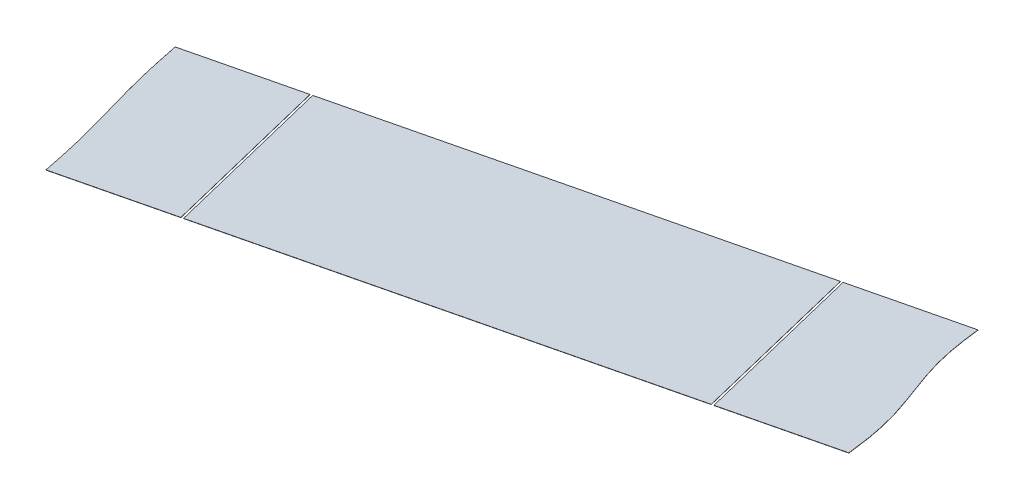
ISO-10303-21;
HEADER;
FILE_DESCRIPTION(('STEP AP214'),'2;1');
FILE_NAME('part.step','',(''),(''),'','','');
FILE_SCHEMA(('AUTOMOTIVE_DESIGN { 1 0 10303 214 1 1 1 1 }'));
ENDSEC;
DATA;
#1=APPLICATION_CONTEXT('core data for automotive mechanical design processes');
#2=APPLICATION_PROTOCOL_DEFINITION('international standard','automotive_design',2000,#1);
#3=PRODUCT_CONTEXT('',#1,'mechanical');
#4=PRODUCT('Part','Part','',(#3));
#5=PRODUCT_RELATED_PRODUCT_CATEGORY('part','',(#4));
#6=PRODUCT_DEFINITION_FORMATION('','',#4);
#7=PRODUCT_DEFINITION_CONTEXT('part definition',#1,'design');
#8=PRODUCT_DEFINITION('design','',#6,#7);
#9=PRODUCT_DEFINITION_SHAPE('','',#8);
#10=(LENGTH_UNIT() NAMED_UNIT(*) SI_UNIT(.MILLI.,.METRE.));
#11=(NAMED_UNIT(*) PLANE_ANGLE_UNIT() SI_UNIT($,.RADIAN.));
#12=(NAMED_UNIT(*) SI_UNIT($,.STERADIAN.) SOLID_ANGLE_UNIT());
#13=UNCERTAINTY_MEASURE_WITH_UNIT(LENGTH_MEASURE(1.E-05),#10,'distance_accuracy_value','');
#14=(GEOMETRIC_REPRESENTATION_CONTEXT(3) GLOBAL_UNCERTAINTY_ASSIGNED_CONTEXT((#13)) GLOBAL_UNIT_ASSIGNED_CONTEXT((#10,
#11,#12)) REPRESENTATION_CONTEXT('',''));
#15=CARTESIAN_POINT('',(0.,0.,0.));
#16=DIRECTION('',(0.,0.,1.));
#17=DIRECTION('',(1.,0.,0.));
#18=AXIS2_PLACEMENT_3D('',#15,#16,#17);
#19=CARTESIAN_POINT('',(2395.27818483003,381.38489247794,252.447974601586));
#20=DIRECTION('',(0.235073047336167,-0.00396825396826431,0.971969606199974));
#21=DIRECTION('',(0.971977259112275,0.,-0.235074898210314));
#22=AXIS2_PLACEMENT_3D('',#19,#20,#21);
#23=PLANE('',#22);
#24=DIRECTION('',(0.000932836897662165,0.999992126449225,0.00385705261553395));
#25=VECTOR('',#24,1.);
#26=CARTESIAN_POINT('',(2345.08494572677,371.384971213448,264.546496375752));
#27=LINE('',#26,#25);
#28=CARTESIAN_POINT('',(2345.09418081205,381.284893265295,264.584681196645));
#29=VERTEX_POINT('',#28);
#30=CARTESIAN_POINT('',(2345.09427409574,381.38489247794,264.585066901907));
#31=VERTEX_POINT('',#30);
#32=EDGE_CURVE('E119',#29,#31,#27,.T.);
#33=ORIENTED_EDGE('',*,*,#32,.T.);
#34=DIRECTION('',(-0.971977259112275,0.,0.235074898210314));
#35=VECTOR('',#34,1.);
#36=CARTESIAN_POINT('',(2395.27818483003,381.38489247794,252.447974601586));
#37=LINE('',#36,#35);
#38=CARTESIAN_POINT('',(2152.64277679151,381.38489247794,311.129896747549));
#39=VERTEX_POINT('',#38);
#40=EDGE_CURVE('E55',#31,#39,#37,.T.);
#41=ORIENTED_EDGE('',*,*,#40,.T.);
#42=DIRECTION('',(0.000932836897662165,0.999992126449225,0.00385705261553395));
#43=VECTOR('',#42,1.);
#44=CARTESIAN_POINT('',(2152.63344842254,371.384971213448,311.091326221394));
#45=LINE('',#44,#43);
#46=CARTESIAN_POINT('',(2152.64268350782,381.284893265295,311.129511042288));
#47=VERTEX_POINT('',#46);
#48=EDGE_CURVE('E114',#47,#39,#45,.T.);
#49=ORIENTED_EDGE('',*,*,#48,.F.);
#50=DIRECTION('',(-0.971977259112275,0.,0.235074898210314));
#51=VECTOR('',#50,1.);
#52=CARTESIAN_POINT('',(2395.27809154634,381.284893265295,252.447588896325));
#53=LINE('',#52,#51);
#54=EDGE_CURVE('E84',#29,#47,#53,.T.);
#55=ORIENTED_EDGE('',*,*,#54,.F.);
#56=EDGE_LOOP('',(#33,#41,#49,#55));
#57=FACE_BOUND('',#56,.T.);
#58=ADVANCED_FACE('F52',(#57),#23,.T.);
#59=CARTESIAN_POINT('',(2376.60605366932,381.699900005905,175.293985663563));
#60=DIRECTION('',(0.235073047336167,-0.00396825396826431,0.971969606199973));
#61=DIRECTION('',(0.971977259112275,0.,-0.235074898210314));
#62=AXIS2_PLACEMENT_3D('',#59,#60,#61);
#63=PLANE('',#62);
#64=DIRECTION('',(-0.971977259112275,0.,0.235074898210314));
#65=VECTOR('',#64,1.);
#66=CARTESIAN_POINT('',(2376.60605366932,381.699900005905,175.293985663563));
#67=LINE('',#66,#65);
#68=CARTESIAN_POINT('',(2326.4337296536,381.699900005905,187.428275689794));
#69=VERTEX_POINT('',#68);
#70=CARTESIAN_POINT('',(2133.98223234937,381.699900005905,233.973105535437));
#71=VERTEX_POINT('',#70);
#72=EDGE_CURVE('E111',#69,#71,#67,.T.);
#73=ORIENTED_EDGE('',*,*,#72,.F.);
#74=DIRECTION('',(0.000932836897662165,0.999992126449225,0.00385705261553395));
#75=VECTOR('',#74,1.);
#76=CARTESIAN_POINT('',(2326.42440128462,371.699978741413,187.389705163639));
#77=LINE('',#76,#75);
#78=CARTESIAN_POINT('',(2326.43363636991,381.59990079326,187.427889984532));
#79=VERTEX_POINT('',#78);
#80=EDGE_CURVE('E61',#79,#69,#77,.T.);
#81=ORIENTED_EDGE('',*,*,#80,.F.);
#82=DIRECTION('',(-0.971977259112275,0.,0.235074898210314));
#83=VECTOR('',#82,1.);
#84=CARTESIAN_POINT('',(2376.60596038563,381.59990079326,175.293599958301));
#85=LINE('',#84,#83);
#86=CARTESIAN_POINT('',(2133.98213906568,381.59990079326,233.972719830176));
#87=VERTEX_POINT('',#86);
#88=EDGE_CURVE('E100',#79,#87,#85,.T.);
#89=ORIENTED_EDGE('',*,*,#88,.T.);
#90=DIRECTION('',(0.000932836897662165,0.999992126449225,0.00385705261553395));
#91=VECTOR('',#90,1.);
#92=CARTESIAN_POINT('',(2133.97290398039,371.699978741413,233.934535009282));
#93=LINE('',#92,#91);
#94=EDGE_CURVE('E104',#87,#71,#93,.T.);
#95=ORIENTED_EDGE('',*,*,#94,.T.);
#96=EDGE_LOOP('',(#73,#81,#89,#95));
#97=FACE_BOUND('',#96,.T.);
#98=ADVANCED_FACE('F103',(#97),#63,.F.);
#99=CARTESIAN_POINT('',(4596.43898357471,393.653775003779,-3460.77851322098));
#100=DIRECTION('',(0.000932836897662165,0.999992126449225,0.00385705261553395));
#101=DIRECTION('',(0.,-0.00385705429370909,0.999992561538422));
#102=AXIS2_PLACEMENT_3D('',#99,#100,#101);
#103=PLANE('',#102);
#104=DIRECTION('',(0.235073047336166,-0.0039682539682627,0.971969606199974));
#105=VECTOR('',#104,1.);
#106=CARTESIAN_POINT('',(2345.09427409574,381.38489247794,264.585066901907));
#107=LINE('',#106,#105);
#108=EDGE_CURVE('E14',#69,#31,#107,.T.);
#109=ORIENTED_EDGE('',*,*,#108,.F.);
#110=ORIENTED_EDGE('',*,*,#72,.T.);
#111=DIRECTION('',(-0.235073047336166,0.0039682539682634,-0.971969606199974));
#112=VECTOR('',#111,1.);
#113=CARTESIAN_POINT('',(2152.64277679151,381.38489247794,311.129896747549));
#114=LINE('',#113,#112);
#115=EDGE_CURVE('E110',#39,#71,#114,.T.);
#116=ORIENTED_EDGE('',*,*,#115,.F.);
#117=ORIENTED_EDGE('',*,*,#40,.F.);
#118=EDGE_LOOP('',(#109,#110,#116,#117));
#119=FACE_BOUND('',#118,.T.);
#120=ADVANCED_FACE('F125',(#119),#103,.T.);
#121=CARTESIAN_POINT('',(4596.43889029102,393.553775791134,-3460.77889892624));
#122=DIRECTION('',(0.000932836897662165,0.999992126449225,0.00385705261553395));
#123=DIRECTION('',(0.,-0.00385705429370909,0.999992561538422));
#124=AXIS2_PLACEMENT_3D('',#121,#122,#123);
#125=PLANE('',#124);
#126=ORIENTED_EDGE('',*,*,#88,.F.);
#127=DIRECTION('',(0.235073047336166,-0.00396825396826328,0.971969606199974));
#128=VECTOR('',#127,1.);
#129=CARTESIAN_POINT('',(1618.30511291864,393.553775791134,-2740.51050991896));
#130=LINE('',#129,#128);
#131=EDGE_CURVE('E70',#79,#29,#130,.T.);
#132=ORIENTED_EDGE('',*,*,#131,.T.);
#133=ORIENTED_EDGE('',*,*,#54,.T.);
#134=DIRECTION('',(-0.235073047336166,0.00396825396826328,-0.971969606199974));
#135=VECTOR('',#134,1.);
#136=CARTESIAN_POINT('',(1425.85361561441,393.553775791134,-2693.96568007332));
#137=LINE('',#136,#135);
#138=EDGE_CURVE('E108',#47,#87,#137,.T.);
#139=ORIENTED_EDGE('',*,*,#138,.T.);
#140=EDGE_LOOP('',(#126,#132,#133,#139));
#141=FACE_BOUND('',#140,.T.);
#142=ADVANCED_FACE('F113',(#141),#125,.F.);
#143=CARTESIAN_POINT('',(2152.63344842254,371.384971213448,311.091326221394));
#144=DIRECTION('',(0.971977259112275,0.,-0.235074898210313));
#145=DIRECTION('',(-0.235074898210313,0.,-0.971977259112275));
#146=AXIS2_PLACEMENT_3D('',#143,#144,#145);
#147=PLANE('',#146);
#148=ORIENTED_EDGE('',*,*,#48,.T.);
#149=ORIENTED_EDGE('',*,*,#115,.T.);
#150=ORIENTED_EDGE('',*,*,#94,.F.);
#151=ORIENTED_EDGE('',*,*,#138,.F.);
#152=EDGE_LOOP('',(#148,#149,#150,#151));
#153=FACE_BOUND('',#152,.T.);
#154=ADVANCED_FACE('F107',(#153),#147,.F.);
#155=CARTESIAN_POINT('',(2345.08494572677,371.384971213448,264.546496375752));
#156=DIRECTION('',(-0.971977259112275,0.,0.235074898210313));
#157=DIRECTION('',(0.235074898210313,0.,0.971977259112275));
#158=AXIS2_PLACEMENT_3D('',#155,#156,#157);
#159=PLANE('',#158);
#160=ORIENTED_EDGE('',*,*,#80,.T.);
#161=ORIENTED_EDGE('',*,*,#108,.T.);
#162=ORIENTED_EDGE('',*,*,#32,.F.);
#163=ORIENTED_EDGE('',*,*,#131,.F.);
#164=EDGE_LOOP('',(#160,#161,#162,#163));
#165=FACE_BOUND('',#164,.T.);
#166=ADVANCED_FACE('F126',(#165),#159,.F.);
#167=CLOSED_SHELL('',(#58,#98,#120,#142,#154,#166));
#168=MANIFOLD_SOLID_BREP('B2',#167);
#169=CARTESIAN_POINT('',(2395.27818483003,381.38489247794,252.447974601588));
#170=CARTESIAN_POINT('',(2395.23043806307,381.386475828937,252.049017486661));
#171=CARTESIAN_POINT('',(2395.20393658994,381.387353474253,251.82788572132));
#172=CARTESIAN_POINT('',(2395.1628766104,381.388713251445,251.485275870303));
#173=CARTESIAN_POINT('',(2395.04691486838,381.392539552048,250.521302221176));
#174=CARTESIAN_POINT('',(2394.97939194031,381.394736463189,249.968054397501));
#175=CARTESIAN_POINT('',(2394.89889819591,381.397355389959,249.308530437594));
#176=CARTESIAN_POINT('',(2394.74563612036,381.402230432094,248.081677784998));
#177=CARTESIAN_POINT('',(2394.5869958183,381.407125548774,246.850921276371));
#178=CARTESIAN_POINT('',(2394.42203773334,381.412029851866,245.619311038399));
#179=CARTESIAN_POINT('',(2394.249679362,381.416939111286,244.3882055827));
#180=CARTESIAN_POINT('',(2394.06884033133,381.421851335165,243.15838261807));
#181=CARTESIAN_POINT('',(2393.87849290869,381.426765460672,241.930366257451));
#182=CARTESIAN_POINT('',(2393.67768678359,381.431680869076,240.704546749305));
#183=CARTESIAN_POINT('',(2393.3567261223,381.439119704293,238.853554965963));
#184=CARTESIAN_POINT('',(2392.88427536881,381.448926602792,236.425249541687));
#185=CARTESIAN_POINT('',(2392.35812533769,381.45873768294,234.008847260779));
#186=CARTESIAN_POINT('',(2391.77629424682,381.46854999921,231.605591089257));
#187=CARTESIAN_POINT('',(2391.13895372857,381.478361027339,229.216093965902));
#188=CARTESIAN_POINT('',(2390.44847923605,381.488167802758,226.840549985927));
#189=CARTESIAN_POINT('',(2389.8873545186,381.495607209398,225.047494273707));
#190=CARTESIAN_POINT('',(2389.50536417124,381.500522573771,223.865505994966));
#191=CARTESIAN_POINT('',(2389.11310601985,381.50543663671,222.686338422213));
#192=CARTESIAN_POINT('',(2388.71160877714,381.51034876524,221.509906865832));
#193=CARTESIAN_POINT('',(2388.30203165184,381.51525787297,220.336212629867));
#194=CARTESIAN_POINT('',(2387.88569899485,381.52016191177,219.165466421711));
#195=CARTESIAN_POINT('',(2387.46421042761,381.525056499953,217.99841738028));
#196=CARTESIAN_POINT('',(2387.03983997006,381.529930269629,216.83746280521));
#197=CARTESIAN_POINT('',(2386.80972366495,381.532552256674,216.21333198286));
#198=CARTESIAN_POINT('',(2386.6175821275,381.534741552308,215.692197873267));
#199=CARTESIAN_POINT('',(2386.28015153993,381.538568084275,214.781726980864));
#200=CARTESIAN_POINT('',(2386.15944954054,381.539935245611,214.456464295289));
#201=CARTESIAN_POINT('',(2386.08703290556,381.540755490709,214.261318984586));
#202=CARTESIAN_POINT('',(2385.79722945633,381.544036722958,213.480705556626));
#203=CARTESIAN_POINT('',(2385.72478895881,381.544857238235,213.285495969862));
#204=CARTESIAN_POINT('',(2385.60412036883,381.546224020972,212.960323360767));
#205=CARTESIAN_POINT('',(2385.26668995383,381.550050550034,212.049853180061));
#206=CARTESIAN_POINT('',(2385.0745148344,381.552240227172,211.528628282291));
#207=CARTESIAN_POINT('',(2384.84443314799,381.554861818406,210.904591706526));
#208=CARTESIAN_POINT('',(2384.42006203296,381.559735591872,209.743636307694));
#209=CARTESIAN_POINT('',(2383.9985729136,381.564630181551,208.576587011984));
#210=CARTESIAN_POINT('',(2383.58224000227,381.569534217143,207.405841697191));
#211=CARTESIAN_POINT('',(2383.17266242661,381.574443322779,206.232148112981));
#212=CARTESIAN_POINT('',(2382.77116432678,381.579355453027,205.055716318414));
#213=CARTESIAN_POINT('',(2382.3789052935,381.584269517127,203.876548657961));
#214=CARTESIAN_POINT('',(2381.99691419463,381.589184880004,202.694560948861));
#215=CARTESIAN_POINT('',(2381.43578795381,381.596624288075,200.901505234153));
#216=CARTESIAN_POINT('',(2380.74531136506,381.606431063908,198.525961653805));
#217=CARTESIAN_POINT('',(2380.10796866581,381.616242091816,196.136465115202));
#218=CARTESIAN_POINT('',(2379.81411411264,381.621197795887,194.922702393091));
#219=CARTESIAN_POINT('',(2379.52089247303,381.626147649874,193.710303311167));
#220=CARTESIAN_POINT('',(2378.99588934764,381.635946366146,191.296829147841));
#221=CARTESIAN_POINT('',(2378.52442497964,381.645740893277,188.871492605338));
#222=CARTESIAN_POINT('',(2378.2040869677,381.653170442814,187.022757668745));
#223=CARTESIAN_POINT('',(2378.0036577206,381.658079629618,185.79846004422));
#224=CARTESIAN_POINT('',(2377.81365091551,381.662987535936,184.571973711802));
#225=CARTESIAN_POINT('',(2377.63311898325,381.667893542798,183.343688318938));
#226=CARTESIAN_POINT('',(2377.46103742198,381.67279658841,182.114126928401));
#227=CARTESIAN_POINT('',(2377.29632947513,381.677694685572,180.884065163846));
#228=CARTESIAN_POINT('',(2377.13791675004,381.68258360714,179.65485978006));
#229=CARTESIAN_POINT('',(2376.9848636719,381.687452483481,178.429555145257));
#230=CARTESIAN_POINT('',(2376.90446338324,381.690068487862,177.770766250962));
#231=CARTESIAN_POINT('',(2376.83704057706,381.692262240636,177.218313061163));
#232=CARTESIAN_POINT('',(2376.72122704763,381.696083694176,176.255560231993));
#233=CARTESIAN_POINT('',(2376.68020779427,381.697442126394,175.913289233635));
#234=CARTESIAN_POINT('',(2376.65374609152,381.698318457059,175.692488690592));
#235=CARTESIAN_POINT('',(2376.60605366931,381.699900005905,175.293985663564));
#236=B_SPLINE_CURVE_WITH_KNOTS('',2,(#169,#170,#171,#172,#173,#174,#175,#176,#177,#178,#179,
#180,#181,#182,#183,#184,#185,#186,#187,#188,#189,#190,#191,#192,#193,#194,#195,#196,#197,#198,
#199,#200,#201,#202,#203,#204,#205,#206,#207,#208,#209,#210,#211,#212,#213,#214,#215,#216,#217,
#218,#219,#220,#221,#222,#223,#224,#225,#226,#227,#228,#229,#230,#231,#232,#233,#234,#235),
.UNSPECIFIED.,.F.,.F.,(3,2,1,2,1,1,1,1,1,1,1,1,1,1,1,1,1,1,1,1,1,1,1,1,1,2,1,2,1,2,1,2,1,1,1,1,
1,1,1,1,1,1,1,1,1,1,1,1,1,1,1,1,1,1,2,1,2,3),(0.,0.0078125,0.015625,0.03125,0.046875,0.0625,
0.078125,0.09375,0.109375,0.125,0.140625,0.15625,0.1875,0.21875,0.25,0.28125,0.3125,0.34375,
0.359375,0.375,0.390625,0.40625,0.421875,0.4375,0.453125,0.46875,0.484375,0.4921875,0.5,
0.5078125,0.515625,0.53125,0.546875,0.5625,0.578125,0.59375,0.609375,0.625,0.640625,0.65625,
0.6875,0.71875,0.75,0.750316619873047,0.781527042388916,0.812737464904785,0.843947887420654,
0.859553098678589,0.875158309936523,0.890763521194458,0.906368732452393,0.921973943710327,
0.937579154968262,0.953184366226196,0.968789577484131,0.984394788742065,0.992197394371033,1.),.UNSPECIFIED.);
#237=DIRECTION('',(-0.000932836897660746,-0.999992126449225,-0.00385705261553536));
#238=VECTOR('',#237,1.);
#239=SURFACE_OF_LINEAR_EXTRUSION('',#236,#238);
#240=CARTESIAN_POINT('',(2395.27809154634,381.284893265295,252.447588896326));
#241=CARTESIAN_POINT('',(2395.23034477938,381.286476616292,252.0486317814));
#242=CARTESIAN_POINT('',(2395.20384330625,381.287354261608,251.827500016058));
#243=CARTESIAN_POINT('',(2395.16278332671,381.2887140388,251.484890165041));
#244=CARTESIAN_POINT('',(2395.04682158469,381.292540339403,250.520916515914));
#245=CARTESIAN_POINT('',(2394.97929865662,381.294737250544,249.96766869224));
#246=CARTESIAN_POINT('',(2394.89880491222,381.297356177314,249.308144732332));
#247=CARTESIAN_POINT('',(2394.74554283667,381.302231219449,248.081292079736));
#248=CARTESIAN_POINT('',(2394.58690253462,381.307126336129,246.85053557111));
#249=CARTESIAN_POINT('',(2394.42194444965,381.312030639222,245.618925333138));
#250=CARTESIAN_POINT('',(2394.24958607831,381.316939898641,244.387819877438));
#251=CARTESIAN_POINT('',(2394.06874704764,381.321852122521,243.157996912808));
#252=CARTESIAN_POINT('',(2393.878399625,381.326766248027,241.929980552189));
#253=CARTESIAN_POINT('',(2393.6775934999,381.331681656432,240.704161044043));
#254=CARTESIAN_POINT('',(2393.35663283861,381.339120491648,238.853169260701));
#255=CARTESIAN_POINT('',(2392.88418208512,381.348927390147,236.424863836426));
#256=CARTESIAN_POINT('',(2392.358032054,381.358738470295,234.008461555518));
#257=CARTESIAN_POINT('',(2391.77620096313,381.368550786565,231.605205383995));
#258=CARTESIAN_POINT('',(2391.13886044488,381.378361814694,229.21570826064));
#259=CARTESIAN_POINT('',(2390.44838595236,381.388168590113,226.840164280665));
#260=CARTESIAN_POINT('',(2389.88726123491,381.395607996753,225.047108568445));
#261=CARTESIAN_POINT('',(2389.50527088755,381.400523361127,223.865120289704));
#262=CARTESIAN_POINT('',(2389.11301273616,381.405437424065,222.685952716952));
#263=CARTESIAN_POINT('',(2388.71151549345,381.410349552595,221.50952116057));
#264=CARTESIAN_POINT('',(2388.30193836815,381.415258660325,220.335826924605));
#265=CARTESIAN_POINT('',(2387.88560571116,381.420162699125,219.16508071645));
#266=CARTESIAN_POINT('',(2387.46411714392,381.425057287308,217.998031675018));
#267=CARTESIAN_POINT('',(2387.03974668637,381.429931056984,216.837077099948));
#268=CARTESIAN_POINT('',(2386.80963038126,381.432553044029,216.212946277598));
#269=CARTESIAN_POINT('',(2386.61748884381,381.434742339663,215.691812168005));
#270=CARTESIAN_POINT('',(2386.28005825624,381.43856887163,214.781341275603));
#271=CARTESIAN_POINT('',(2386.15935625685,381.439936032966,214.456078590027));
#272=CARTESIAN_POINT('',(2386.08693962187,381.440756278064,214.260933279324));
#273=CARTESIAN_POINT('',(2385.79713617264,381.444037510314,213.480319851364));
#274=CARTESIAN_POINT('',(2385.72469567512,381.44485802559,213.285110264601));
#275=CARTESIAN_POINT('',(2385.60402708514,381.446224808327,212.959937655505));
#276=CARTESIAN_POINT('',(2385.26659667015,381.450051337389,212.0494674748));
#277=CARTESIAN_POINT('',(2385.07442155071,381.452241014527,211.528242577029));
#278=CARTESIAN_POINT('',(2384.8443398643,381.454862605761,210.904206001264));
#279=CARTESIAN_POINT('',(2384.41996874927,381.459736379227,209.743250602433));
#280=CARTESIAN_POINT('',(2383.99847962991,381.464630968906,208.576201306723));
#281=CARTESIAN_POINT('',(2383.58214671858,381.469535004498,207.405455991929));
#282=CARTESIAN_POINT('',(2383.17256914292,381.474444110134,206.23176240772));
#283=CARTESIAN_POINT('',(2382.77107104309,381.479356240382,205.055330613153));
#284=CARTESIAN_POINT('',(2382.37881200981,381.484270304482,203.876162952699));
#285=CARTESIAN_POINT('',(2381.99682091094,381.48918566736,202.694175243599));
#286=CARTESIAN_POINT('',(2381.43569467012,381.49662507543,200.901119528892));
#287=CARTESIAN_POINT('',(2380.74521808137,381.506431851263,198.525575948543));
#288=CARTESIAN_POINT('',(2380.10787538212,381.516242879171,196.136079409941));
#289=CARTESIAN_POINT('',(2379.81402082895,381.521198583242,194.922316687829));
#290=CARTESIAN_POINT('',(2379.52079918934,381.526148437229,193.709917605905));
#291=CARTESIAN_POINT('',(2378.99579606395,381.535947153501,191.296443442579));
#292=CARTESIAN_POINT('',(2378.52433169595,381.545741680632,188.871106900077));
#293=CARTESIAN_POINT('',(2378.20399368401,381.553171230169,187.022371963484));
#294=CARTESIAN_POINT('',(2378.00356443691,381.558080416973,185.798074338959));
#295=CARTESIAN_POINT('',(2377.81355763182,381.562988323291,184.57158800654));
#296=CARTESIAN_POINT('',(2377.63302569956,381.567894330153,183.343302613676));
#297=CARTESIAN_POINT('',(2377.46094413829,381.572797375765,182.113741223139));
#298=CARTESIAN_POINT('',(2377.29623619145,381.577695472927,180.883679458584));
#299=CARTESIAN_POINT('',(2377.13782346635,381.582584394495,179.654474074798));
#300=CARTESIAN_POINT('',(2376.98477038821,381.587453270836,178.429169439996));
#301=CARTESIAN_POINT('',(2376.90437009955,381.590069275217,177.770380545701));
#302=CARTESIAN_POINT('',(2376.83694729337,381.592263027991,177.217927355901));
#303=CARTESIAN_POINT('',(2376.72113376394,381.596084481531,176.255174526731));
#304=CARTESIAN_POINT('',(2376.68011451058,381.597442913749,175.912903528373));
#305=CARTESIAN_POINT('',(2376.65365280783,381.598319244414,175.69210298533));
#306=CARTESIAN_POINT('',(2376.60596038562,381.59990079326,175.293599958302));
#307=B_SPLINE_CURVE_WITH_KNOTS('',2,(#240,#241,#242,#243,#244,#245,#246,#247,#248,#249,#250,
#251,#252,#253,#254,#255,#256,#257,#258,#259,#260,#261,#262,#263,#264,#265,#266,#267,#268,#269,
#270,#271,#272,#273,#274,#275,#276,#277,#278,#279,#280,#281,#282,#283,#284,#285,#286,#287,#288,
#289,#290,#291,#292,#293,#294,#295,#296,#297,#298,#299,#300,#301,#302,#303,#304,#305,#306),
.UNSPECIFIED.,.F.,.F.,(3,2,1,2,1,1,1,1,1,1,1,1,1,1,1,1,1,1,1,1,1,1,1,1,1,2,1,2,1,2,1,2,1,1,1,1,
1,1,1,1,1,1,1,1,1,1,1,1,1,1,1,1,1,1,2,1,2,3),(0.,0.0078125,0.015625,0.03125,0.046875,0.0625,
0.078125,0.09375,0.109375,0.125,0.140625,0.15625,0.1875,0.21875,0.25,0.28125,0.3125,0.34375,
0.359375,0.375,0.390625,0.40625,0.421875,0.4375,0.453125,0.46875,0.484375,0.4921875,0.5,
0.5078125,0.515625,0.53125,0.546875,0.5625,0.578125,0.59375,0.609375,0.625,0.640625,0.65625,
0.6875,0.71875,0.75,0.750316619873047,0.781527042388916,0.812737464904785,0.843947887420654,
0.859553098678589,0.875158309936523,0.890763521194458,0.906368732452393,0.921973943710327,
0.937579154968262,0.953184366226196,0.968789577484131,0.984394788742065,0.992197394371033,1.),.UNSPECIFIED.);
#308=CARTESIAN_POINT('',(2395.27809154634,381.284893265295,252.447588896325));
#309=VERTEX_POINT('',#308);
#310=CARTESIAN_POINT('',(2376.60596038562,381.59990079326,175.293599958302));
#311=VERTEX_POINT('',#310);
#312=EDGE_CURVE('E248',#309,#311,#307,.T.);
#313=ORIENTED_EDGE('',*,*,#312,.T.);
#314=DIRECTION('',(-0.000932836897660746,-0.999992126449225,-0.00385705261553536));
#315=VECTOR('',#314,1.);
#316=CARTESIAN_POINT('',(2376.60605366931,381.699900005905,175.293985663563));
#317=LINE('',#316,#315);
#318=CARTESIAN_POINT('',(2376.60605366931,381.699900005905,175.293985663563));
#319=VERTEX_POINT('',#318);
#320=EDGE_CURVE('E242',#319,#311,#317,.T.);
#321=ORIENTED_EDGE('',*,*,#320,.F.);
#322=CARTESIAN_POINT('',(2395.27818483003,381.38489247794,252.447974601587));
#323=VERTEX_POINT('',#322);
#324=EDGE_CURVE('E251',#323,#319,#236,.T.);
#325=ORIENTED_EDGE('',*,*,#324,.F.);
#326=DIRECTION('',(-0.000932836897660746,-0.999992126449225,-0.00385705261553536));
#327=VECTOR('',#326,1.);
#328=CARTESIAN_POINT('',(2395.27818483003,381.38489247794,252.447974601587));
#329=LINE('',#328,#327);
#330=EDGE_CURVE('E193',#323,#309,#329,.T.);
#331=ORIENTED_EDGE('',*,*,#330,.T.);
#332=EDGE_LOOP('',(#313,#321,#325,#331));
#333=FACE_BOUND('',#332,.T.);
#334=ADVANCED_FACE('F185',(#333),#239,.F.);
#335=CARTESIAN_POINT('',(4596.43898357471,393.653775003779,-3460.77851322098));
#336=DIRECTION('',(0.000932836897662165,0.999992126449225,0.00385705261553395));
#337=DIRECTION('',(0.,-0.00385705429370909,0.999992561538422));
#338=AXIS2_PLACEMENT_3D('',#335,#336,#337);
#339=PLANE('',#338);
#340=DIRECTION('',(-0.235073047336171,0.00396825396826269,-0.971969606199972));
#341=VECTOR('',#340,1.);
#342=CARTESIAN_POINT('',(2327.40570691271,381.699900005905,187.193200791584));
#343=LINE('',#342,#341);
#344=CARTESIAN_POINT('',(2346.06625135486,381.38489247794,264.349992003697));
#345=VERTEX_POINT('',#344);
#346=CARTESIAN_POINT('',(2327.40570691271,381.699900005905,187.193200791584));
#347=VERTEX_POINT('',#346);
#348=EDGE_CURVE('E228',#345,#347,#343,.T.);
#349=ORIENTED_EDGE('',*,*,#348,.F.);
#350=DIRECTION('',(-0.971977259112275,0.,0.235074898210314));
#351=VECTOR('',#350,1.);
#352=CARTESIAN_POINT('',(2395.27818483003,381.38489247794,252.447974601586));
#353=LINE('',#352,#351);
#354=EDGE_CURVE('E235',#323,#345,#353,.T.);
#355=ORIENTED_EDGE('',*,*,#354,.F.);
#356=ORIENTED_EDGE('',*,*,#324,.T.);
#357=DIRECTION('',(-0.971977259112275,0.,0.235074898210314));
#358=VECTOR('',#357,1.);
#359=CARTESIAN_POINT('',(2376.60605366932,381.699900005905,175.293985663563));
#360=LINE('',#359,#358);
#361=EDGE_CURVE('E237',#319,#347,#360,.T.);
#362=ORIENTED_EDGE('',*,*,#361,.T.);
#363=EDGE_LOOP('',(#349,#355,#356,#362));
#364=FACE_BOUND('',#363,.T.);
#365=ADVANCED_FACE('F234',(#364),#339,.T.);
#366=CARTESIAN_POINT('',(4596.43889029102,393.553775791134,-3460.77889892624));
#367=DIRECTION('',(0.000932836897662165,0.999992126449225,0.00385705261553395));
#368=DIRECTION('',(0.,-0.00385705429370909,0.999992561538422));
#369=AXIS2_PLACEMENT_3D('',#366,#367,#368);
#370=PLANE('',#369);
#371=DIRECTION('',(-0.971977259112275,0.,0.235074898210314));
#372=VECTOR('',#371,1.);
#373=CARTESIAN_POINT('',(2395.27809154634,381.284893265295,252.447588896325));
#374=LINE('',#373,#372);
#375=CARTESIAN_POINT('',(2346.06615807117,381.284893265295,264.349606298435));
#376=VERTEX_POINT('',#375);
#377=EDGE_CURVE('E247',#309,#376,#374,.T.);
#378=ORIENTED_EDGE('',*,*,#377,.T.);
#379=DIRECTION('',(-0.235073047336171,0.00396825396826328,-0.971969606199973));
#380=VECTOR('',#379,1.);
#381=CARTESIAN_POINT('',(1619.27709017774,393.553775791134,-2740.74558481716));
#382=LINE('',#381,#380);
#383=CARTESIAN_POINT('',(2327.40561362902,381.59990079326,187.192815086323));
#384=VERTEX_POINT('',#383);
#385=EDGE_CURVE('E50',#376,#384,#382,.T.);
#386=ORIENTED_EDGE('',*,*,#385,.T.);
#387=DIRECTION('',(-0.971977259112275,0.,0.235074898210314));
#388=VECTOR('',#387,1.);
#389=CARTESIAN_POINT('',(2376.60596038563,381.59990079326,175.293599958301));
#390=LINE('',#389,#388);
#391=EDGE_CURVE('E239',#311,#384,#390,.T.);
#392=ORIENTED_EDGE('',*,*,#391,.F.);
#393=ORIENTED_EDGE('',*,*,#312,.F.);
#394=EDGE_LOOP('',(#378,#386,#392,#393));
#395=FACE_BOUND('',#394,.T.);
#396=ADVANCED_FACE('F267',(#395),#370,.F.);
#397=CARTESIAN_POINT('',(2376.60605366932,381.699900005905,175.293985663563));
#398=DIRECTION('',(0.235073047336167,-0.00396825396826431,0.971969606199973));
#399=DIRECTION('',(0.971977259112275,0.,-0.235074898210314));
#400=AXIS2_PLACEMENT_3D('',#397,#398,#399);
#401=PLANE('',#400);
#402=ORIENTED_EDGE('',*,*,#391,.T.);
#403=DIRECTION('',(0.000932836897662165,0.999992126449225,0.00385705261553395));
#404=VECTOR('',#403,1.);
#405=CARTESIAN_POINT('',(2327.39637854373,371.699978741413,187.154630265429));
#406=LINE('',#405,#404);
#407=EDGE_CURVE('E200',#384,#347,#406,.T.);
#408=ORIENTED_EDGE('',*,*,#407,.T.);
#409=ORIENTED_EDGE('',*,*,#361,.F.);
#410=ORIENTED_EDGE('',*,*,#320,.T.);
#411=EDGE_LOOP('',(#402,#408,#409,#410));
#412=FACE_BOUND('',#411,.T.);
#413=ADVANCED_FACE('F270',(#412),#401,.F.);
#414=CARTESIAN_POINT('',(2395.27818483003,381.38489247794,252.447974601586));
#415=DIRECTION('',(0.235073047336167,-0.00396825396826431,0.971969606199974));
#416=DIRECTION('',(0.971977259112275,0.,-0.235074898210314));
#417=AXIS2_PLACEMENT_3D('',#414,#415,#416);
#418=PLANE('',#417);
#419=DIRECTION('',(0.000932836897662165,0.999992126449225,0.00385705261553395));
#420=VECTOR('',#419,1.);
#421=CARTESIAN_POINT('',(2346.05692298588,371.384971213448,264.311421477541));
#422=LINE('',#421,#420);
#423=EDGE_CURVE('E225',#376,#345,#422,.T.);
#424=ORIENTED_EDGE('',*,*,#423,.F.);
#425=ORIENTED_EDGE('',*,*,#377,.F.);
#426=ORIENTED_EDGE('',*,*,#330,.F.);
#427=ORIENTED_EDGE('',*,*,#354,.T.);
#428=EDGE_LOOP('',(#424,#425,#426,#427));
#429=FACE_BOUND('',#428,.T.);
#430=ADVANCED_FACE('F187',(#429),#418,.T.);
#431=CARTESIAN_POINT('',(2327.39637854373,371.699978741413,187.154630265429));
#432=DIRECTION('',(0.971977259112274,0.,-0.235074898210318));
#433=DIRECTION('',(-0.235074898210318,0.,-0.971977259112274));
#434=AXIS2_PLACEMENT_3D('',#431,#432,#433);
#435=PLANE('',#434);
#436=ORIENTED_EDGE('',*,*,#423,.T.);
#437=ORIENTED_EDGE('',*,*,#348,.T.);
#438=ORIENTED_EDGE('',*,*,#407,.F.);
#439=ORIENTED_EDGE('',*,*,#385,.F.);
#440=EDGE_LOOP('',(#436,#437,#438,#439));
#441=FACE_BOUND('',#440,.T.);
#442=ADVANCED_FACE('F227',(#441),#435,.F.);
#443=CLOSED_SHELL('',(#334,#365,#396,#413,#430,#442));
#444=MANIFOLD_SOLID_BREP('B8',#443);
#445=CARTESIAN_POINT('',(2083.80990833365,381.699900005905,246.107395561668));
#446=CARTESIAN_POINT('',(2083.96928072871,381.696680757214,246.903483974255));
#447=CARTESIAN_POINT('',(2084.0536629375,381.694978013281,247.324534929572));
#448=CARTESIAN_POINT('',(2084.18870901601,381.692252925917,247.998388828213));
#449=CARTESIAN_POINT('',(2084.29789550136,381.690056020656,248.541558701766));
#450=CARTESIAN_POINT('',(2084.42805649163,381.687437094299,249.189070418955));
#451=CARTESIAN_POINT('',(2084.67149304521,381.682562053809,250.394113743424));
#452=CARTESIAN_POINT('',(2085.05198799818,381.674991493271,252.264858563159));
#453=CARTESIAN_POINT('',(2085.28854029357,381.670368050158,253.406336898813));
#454=CARTESIAN_POINT('',(2085.55032974736,381.665251343745,254.669596633875));
#455=CARTESIAN_POINT('',(2086.06259919758,381.655470924884,257.081406618583));
#456=CARTESIAN_POINT('',(2086.59026303072,381.645672779719,259.494089216761));
#457=CARTESIAN_POINT('',(2087.13349844031,381.635891144138,261.898725464873));
#458=CARTESIAN_POINT('',(2087.69335529534,381.626129296767,264.2942114226));
#459=CARTESIAN_POINT('',(2087.9854748907,381.621198042888,265.502054711323));
#460=CARTESIAN_POINT('',(2088.2791296725,381.6162424863,266.715827511614));
#461=CARTESIAN_POINT('',(2088.87910995113,381.606431454516,269.114361241211));
#462=CARTESIAN_POINT('',(2089.49670322863,381.596624678433,271.507531879947));
#463=CARTESIAN_POINT('',(2090.13019063557,381.586826780464,273.894556718614));
#464=CARTESIAN_POINT('',(2090.77690619256,381.577046886372,276.273714555015));
#465=CARTESIAN_POINT('',(2091.12157106394,381.571928197669,277.517444617558));
#466=CARTESIAN_POINT('',(2091.43266977171,381.567308006948,278.640050509228));
#467=CARTESIAN_POINT('',(2091.94932298622,381.559735978082,280.478245828942));
#468=CARTESIAN_POINT('',(2092.28343322379,381.554862211311,281.661029289301));
#469=CARTESIAN_POINT('',(2092.46378448251,381.552240227172,282.297195147259));
#470=CARTESIAN_POINT('',(2092.61437284168,381.550050942261,282.828376206849));
#471=CARTESIAN_POINT('',(2092.80272215135,381.547318234547,283.491314275643));
#472=CARTESIAN_POINT('',(2092.91582852637,381.545677205631,283.889417788514));
#473=CARTESIAN_POINT('',(2093.36838819927,381.539115593909,285.481150209433));
#474=CARTESIAN_POINT('',(2093.481516348,381.537474249298,285.87933030429));
#475=CARTESIAN_POINT('',(2093.66983726183,381.534741953928,286.54216833507));
#476=CARTESIAN_POINT('',(2093.82045401683,381.532552256674,287.073449432675));
#477=CARTESIAN_POINT('',(2094.00077810953,381.529930668055,287.709519316736));
#478=CARTESIAN_POINT('',(2094.33488868985,381.525056897891,288.892303574066));
#479=CARTESIAN_POINT('',(2094.85154173466,381.517484874712,290.730497460294));
#480=CARTESIAN_POINT('',(2095.1626674354,381.512864286176,291.853199962375));
#481=CARTESIAN_POINT('',(2095.50730530613,381.50774600186,293.096831712693));
#482=CARTESIAN_POINT('',(2096.15402212465,381.497966096821,295.475992081962));
#483=CARTESIAN_POINT('',(2096.78751038974,381.488168195106,297.863017684247));
#484=CARTESIAN_POINT('',(2097.40510428026,381.478361420224,300.256187863584));
#485=CARTESIAN_POINT('',(2098.00508493676,381.468550394223,302.654720002141));
#486=CARTESIAN_POINT('',(2098.58654067498,381.458738079942,305.058066438016));
#487=CARTESIAN_POINT('',(2099.14931462961,381.448926999899,307.465611112892));
#488=CARTESIAN_POINT('',(2099.6939539394,381.439120098068,309.876458435529));
#489=CARTESIAN_POINT('',(2100.22161885949,381.429321944133,312.289143044665));
#490=CARTESIAN_POINT('',(2100.73388873737,381.419541527015,314.700952473873));
#491=CARTESIAN_POINT('',(2100.99569820578,381.414424433687,315.964307681119));
#492=CARTESIAN_POINT('',(2101.23223058731,381.409801383654,317.105688921895));
#493=CARTESIAN_POINT('',(2101.6127252561,381.402230833321,318.976431164459));
#494=CARTESIAN_POINT('',(2101.85616265902,381.397355778095,320.181478104041));
#495=CARTESIAN_POINT('',(2101.98634299798,381.394736463189,320.829085878166));
#496=CARTESIAN_POINT('',(2102.09551058251,381.392539938863,321.372161560602));
#497=CARTESIAN_POINT('',(2102.23057556185,381.389814470565,322.046109650361));
#498=CARTESIAN_POINT('',(2102.31494368076,381.388112011241,322.467090224722));
#499=CARTESIAN_POINT('',(2102.4743301657,381.38489247794,323.263249018265));
#500=B_SPLINE_CURVE_WITH_KNOTS('',2,(#445,#446,#447,#448,#449,#450,#451,#452,#453,#454,#455,
#456,#457,#458,#459,#460,#461,#462,#463,#464,#465,#466,#467,#468,#469,#470,#471,#472,#473,#474,
#475,#476,#477,#478,#479,#480,#481,#482,#483,#484,#485,#486,#487,#488,#489,#490,#491,#492,#493,
#494,#495,#496,#497,#498,#499),.UNSPECIFIED.,.F.,.F.,(3,2,2,1,1,2,1,1,1,1,1,1,1,1,1,1,2,1,1,2,2,
1,2,2,1,1,2,1,1,1,1,1,1,1,1,1,2,1,1,2,2,3),(0.,0.015625,0.03125,0.046875,0.0625,0.09375,0.125,
0.15625,0.1875,0.218592166900635,0.24968433380127,0.25,0.28125,0.3125,0.34375,0.375,0.40625,
0.4375,0.453125,0.46875,0.484375,0.5,0.515625,0.53125,0.546875,0.5625,0.59375,0.625,0.65625,
0.6875,0.71875,0.75,0.78125,0.8125,0.84375,0.875,0.90625,0.9375,0.953125,0.96875,0.984375,1.),.UNSPECIFIED.);
#501=DIRECTION('',(-0.000932836897660746,-0.999992126449225,-0.00385705261553536));
#502=VECTOR('',#501,1.);
#503=SURFACE_OF_LINEAR_EXTRUSION('',#500,#502);
#504=CARTESIAN_POINT('',(2083.80981504996,381.59990079326,246.107009856407));
#505=CARTESIAN_POINT('',(2083.96918744502,381.596681544569,246.903098268993));
#506=CARTESIAN_POINT('',(2084.05356965381,381.594978800636,247.324149224311));
#507=CARTESIAN_POINT('',(2084.18861573232,381.592253713272,247.998003122952));
#508=CARTESIAN_POINT('',(2084.29780221767,381.590056808011,248.541172996505));
#509=CARTESIAN_POINT('',(2084.42796320794,381.587437881654,249.188684713693));
#510=CARTESIAN_POINT('',(2084.67139976152,381.582562841165,250.393728038162));
#511=CARTESIAN_POINT('',(2085.05189471449,381.574992280626,252.264472857898));
#512=CARTESIAN_POINT('',(2085.28844700988,381.570368837514,253.405951193552));
#513=CARTESIAN_POINT('',(2085.55023646367,381.5652521311,254.669210928614));
#514=CARTESIAN_POINT('',(2086.06250591389,381.555471712239,257.081020913321));
#515=CARTESIAN_POINT('',(2086.59016974703,381.545673567074,259.4937035115));
#516=CARTESIAN_POINT('',(2087.13340515662,381.535891931493,261.898339759611));
#517=CARTESIAN_POINT('',(2087.69326201165,381.526130084122,264.293825717339));
#518=CARTESIAN_POINT('',(2087.98538160701,381.521198830243,265.501669006061));
#519=CARTESIAN_POINT('',(2088.27903638881,381.516243273655,266.715441806352));
#520=CARTESIAN_POINT('',(2088.87901666744,381.506432241871,269.113975535949));
#521=CARTESIAN_POINT('',(2089.49660994494,381.496625465788,271.507146174685));
#522=CARTESIAN_POINT('',(2090.13009735188,381.486827567819,273.894171013353));
#523=CARTESIAN_POINT('',(2090.77681290887,381.477047673727,276.273328849754));
#524=CARTESIAN_POINT('',(2091.12147778025,381.471928985025,277.517058912297));
#525=CARTESIAN_POINT('',(2091.43257648802,381.467308794303,278.639664803966));
#526=CARTESIAN_POINT('',(2091.94922970253,381.459736765437,280.477860123681));
#527=CARTESIAN_POINT('',(2092.2833399401,381.454862998666,281.66064358404));
#528=CARTESIAN_POINT('',(2092.46369119883,381.452241014527,282.296809441997));
#529=CARTESIAN_POINT('',(2092.61427955799,381.450051729616,282.827990501587));
#530=CARTESIAN_POINT('',(2092.80262886766,381.447319021902,283.490928570381));
#531=CARTESIAN_POINT('',(2092.91573524268,381.445677992986,283.889032083252));
#532=CARTESIAN_POINT('',(2093.36829491558,381.439116381264,285.480764504171));
#533=CARTESIAN_POINT('',(2093.48142306431,381.437475036653,285.878944599029));
#534=CARTESIAN_POINT('',(2093.66974397814,381.434742741283,286.541782629808));
#535=CARTESIAN_POINT('',(2093.82036073314,381.432553044029,287.073063727413));
#536=CARTESIAN_POINT('',(2094.00068482584,381.429931455411,287.709133611475));
#537=CARTESIAN_POINT('',(2094.33479540616,381.425057685246,288.891917868804));
#538=CARTESIAN_POINT('',(2094.85144845097,381.417485662067,290.730111755032));
#539=CARTESIAN_POINT('',(2095.16257415171,381.412865073531,291.852814257113));
#540=CARTESIAN_POINT('',(2095.50721202244,381.407746789215,293.096446007432));
#541=CARTESIAN_POINT('',(2096.15392884096,381.397966884176,295.4756063767));
#542=CARTESIAN_POINT('',(2096.78741710605,381.388168982461,297.862631978985));
#543=CARTESIAN_POINT('',(2097.40501099657,381.378362207579,300.255802158322));
#544=CARTESIAN_POINT('',(2098.00499165307,381.368551181579,302.654334296879));
#545=CARTESIAN_POINT('',(2098.58644739129,381.358738867297,305.057680732755));
#546=CARTESIAN_POINT('',(2099.14922134592,381.348927787254,307.465225407631));
#547=CARTESIAN_POINT('',(2099.69386065571,381.339120885423,309.876072730267));
#548=CARTESIAN_POINT('',(2100.2215255758,381.329322731488,312.288757339404));
#549=CARTESIAN_POINT('',(2100.73379545368,381.319542314371,314.700566768611));
#550=CARTESIAN_POINT('',(2100.99560492209,381.314425221042,315.963921975858));
#551=CARTESIAN_POINT('',(2101.23213730362,381.309802171009,317.105303216633));
#552=CARTESIAN_POINT('',(2101.61263197241,381.302231620676,318.976045459198));
#553=CARTESIAN_POINT('',(2101.85606937533,381.29735656545,320.181092398779));
#554=CARTESIAN_POINT('',(2101.98624971429,381.294737250544,320.828700172905));
#555=CARTESIAN_POINT('',(2102.09541729882,381.292540726218,321.37177585534));
#556=CARTESIAN_POINT('',(2102.23048227816,381.28981525792,322.045723945099));
#557=CARTESIAN_POINT('',(2102.31485039707,381.288112798596,322.46670451946));
#558=CARTESIAN_POINT('',(2102.47423688201,381.284893265295,323.262863313003));
#559=B_SPLINE_CURVE_WITH_KNOTS('',2,(#504,#505,#506,#507,#508,#509,#510,#511,#512,#513,#514,
#515,#516,#517,#518,#519,#520,#521,#522,#523,#524,#525,#526,#527,#528,#529,#530,#531,#532,#533,
#534,#535,#536,#537,#538,#539,#540,#541,#542,#543,#544,#545,#546,#547,#548,#549,#550,#551,#552,
#553,#554,#555,#556,#557,#558),.UNSPECIFIED.,.F.,.F.,(3,2,2,1,1,2,1,1,1,1,1,1,1,1,1,1,2,1,1,2,2,
1,2,2,1,1,2,1,1,1,1,1,1,1,1,1,2,1,1,2,2,3),(0.,0.015625,0.03125,0.046875,0.0625,0.09375,0.125,
0.15625,0.1875,0.218592166900635,0.24968433380127,0.25,0.28125,0.3125,0.34375,0.375,0.40625,
0.4375,0.453125,0.46875,0.484375,0.5,0.515625,0.53125,0.546875,0.5625,0.59375,0.625,0.65625,
0.6875,0.71875,0.75,0.78125,0.8125,0.84375,0.875,0.90625,0.9375,0.953125,0.96875,0.984375,1.),.UNSPECIFIED.);
#560=CARTESIAN_POINT('',(2083.80981504996,381.59990079326,246.107009856407));
#561=VERTEX_POINT('',#560);
#562=CARTESIAN_POINT('',(2102.47423688201,381.284893265295,323.262863313003));
#563=VERTEX_POINT('',#562);
#564=EDGE_CURVE('E360',#561,#563,#559,.T.);
#565=ORIENTED_EDGE('',*,*,#564,.T.);
#566=DIRECTION('',(-0.000932836897660746,-0.999992126449225,-0.00385705261553536));
#567=VECTOR('',#566,1.);
#568=CARTESIAN_POINT('',(2102.4743301657,381.38489247794,323.263249018265));
#569=LINE('',#568,#567);
#570=CARTESIAN_POINT('',(2102.4743301657,381.38489247794,323.263249018265));
#571=VERTEX_POINT('',#570);
#572=EDGE_CURVE('E364',#571,#563,#569,.T.);
#573=ORIENTED_EDGE('',*,*,#572,.F.);
#574=CARTESIAN_POINT('',(2083.80990833365,381.699900005905,246.107395561668));
#575=VERTEX_POINT('',#574);
#576=EDGE_CURVE('E367',#575,#571,#500,.T.);
#577=ORIENTED_EDGE('',*,*,#576,.F.);
#578=DIRECTION('',(-0.000932836897660746,-0.999992126449225,-0.00385705261553536));
#579=VECTOR('',#578,1.);
#580=CARTESIAN_POINT('',(2083.80990833365,381.699900005905,246.107395561668));
#581=LINE('',#580,#579);
#582=EDGE_CURVE('E328',#575,#561,#581,.T.);
#583=ORIENTED_EDGE('',*,*,#582,.T.);
#584=EDGE_LOOP('',(#565,#573,#577,#583));
#585=FACE_BOUND('',#584,.T.);
#586=ADVANCED_FACE('F320',(#585),#503,.F.);
#587=CARTESIAN_POINT('',(4596.43889029102,393.553775791134,-3460.77889892624));
#588=DIRECTION('',(0.000932836897662165,0.999992126449225,0.00385705261553395));
#589=DIRECTION('',(0.,-0.00385705429370909,0.999992561538422));
#590=AXIS2_PLACEMENT_3D('',#587,#588,#589);
#591=PLANE('',#590);
#592=DIRECTION('',(-0.971977259112275,0.,0.235074898210314));
#593=VECTOR('',#592,1.);
#594=CARTESIAN_POINT('',(2376.60596038563,381.59990079326,175.293599958301));
#595=LINE('',#594,#593);
#596=CARTESIAN_POINT('',(2133.01016180656,381.59990079326,234.207794728386));
#597=VERTEX_POINT('',#596);
#598=EDGE_CURVE('E361',#597,#561,#595,.T.);
#599=ORIENTED_EDGE('',*,*,#598,.F.);
#600=DIRECTION('',(0.235073047336172,-0.00396825396826328,0.971969606199973));
#601=VECTOR('',#600,1.);
#602=CARTESIAN_POINT('',(1424.88163835529,393.553775791134,-2693.73060517509));
#603=LINE('',#602,#601);
#604=CARTESIAN_POINT('',(2151.67070624871,381.284893265295,311.364585940498));
#605=VERTEX_POINT('',#604);
#606=EDGE_CURVE('E183',#597,#605,#603,.T.);
#607=ORIENTED_EDGE('',*,*,#606,.T.);
#608=DIRECTION('',(-0.971977259112275,0.,0.235074898210314));
#609=VECTOR('',#608,1.);
#610=CARTESIAN_POINT('',(2395.27809154634,381.284893265295,252.447588896325));
#611=LINE('',#610,#609);
#612=EDGE_CURVE('E356',#605,#563,#611,.T.);
#613=ORIENTED_EDGE('',*,*,#612,.T.);
#614=ORIENTED_EDGE('',*,*,#564,.F.);
#615=EDGE_LOOP('',(#599,#607,#613,#614));
#616=FACE_BOUND('',#615,.T.);
#617=ADVANCED_FACE('F358',(#616),#591,.F.);
#618=CARTESIAN_POINT('',(4596.43898357471,393.653775003779,-3460.77851322098));
#619=DIRECTION('',(0.000932836897662165,0.999992126449225,0.00385705261553395));
#620=DIRECTION('',(0.,-0.00385705429370909,0.999992561538422));
#621=AXIS2_PLACEMENT_3D('',#618,#619,#620);
#622=PLANE('',#621);
#623=DIRECTION('',(0.235073047336172,-0.00396825396826339,0.971969606199972));
#624=VECTOR('',#623,1.);
#625=CARTESIAN_POINT('',(2133.01025509025,381.699900005905,234.208180433647));
#626=LINE('',#625,#624);
#627=CARTESIAN_POINT('',(2133.01025509025,381.699900005905,234.208180433647));
#628=VERTEX_POINT('',#627);
#629=CARTESIAN_POINT('',(2151.6707995324,381.38489247794,311.36497164576));
#630=VERTEX_POINT('',#629);
#631=EDGE_CURVE('E410',#628,#630,#626,.T.);
#632=ORIENTED_EDGE('',*,*,#631,.F.);
#633=DIRECTION('',(-0.971977259112275,0.,0.235074898210314));
#634=VECTOR('',#633,1.);
#635=CARTESIAN_POINT('',(2376.60605366932,381.699900005905,175.293985663563));
#636=LINE('',#635,#634);
#637=EDGE_CURVE('E372',#628,#575,#636,.T.);
#638=ORIENTED_EDGE('',*,*,#637,.T.);
#639=ORIENTED_EDGE('',*,*,#576,.T.);
#640=DIRECTION('',(-0.971977259112275,0.,0.235074898210314));
#641=VECTOR('',#640,1.);
#642=CARTESIAN_POINT('',(2395.27818483003,381.38489247794,252.447974601586));
#643=LINE('',#642,#641);
#644=EDGE_CURVE('E342',#630,#571,#643,.T.);
#645=ORIENTED_EDGE('',*,*,#644,.F.);
#646=EDGE_LOOP('',(#632,#638,#639,#645));
#647=FACE_BOUND('',#646,.T.);
#648=ADVANCED_FACE('F394',(#647),#622,.T.);
#649=CARTESIAN_POINT('',(2376.60605366932,381.699900005905,175.293985663563));
#650=DIRECTION('',(0.235073047336167,-0.00396825396826431,0.971969606199973));
#651=DIRECTION('',(0.971977259112275,0.,-0.235074898210314));
#652=AXIS2_PLACEMENT_3D('',#649,#650,#651);
#653=PLANE('',#652);
#654=ORIENTED_EDGE('',*,*,#637,.F.);
#655=DIRECTION('',(0.000932836897662165,0.999992126449225,0.00385705261553395));
#656=VECTOR('',#655,1.);
#657=CARTESIAN_POINT('',(2133.00092672128,371.699978741413,234.169609907492));
#658=LINE('',#657,#656);
#659=EDGE_CURVE('E406',#597,#628,#658,.T.);
#660=ORIENTED_EDGE('',*,*,#659,.F.);
#661=ORIENTED_EDGE('',*,*,#598,.T.);
#662=ORIENTED_EDGE('',*,*,#582,.F.);
#663=EDGE_LOOP('',(#654,#660,#661,#662));
#664=FACE_BOUND('',#663,.T.);
#665=ADVANCED_FACE('F392',(#664),#653,.F.);
#666=CARTESIAN_POINT('',(2395.27818483003,381.38489247794,252.447974601586));
#667=DIRECTION('',(0.235073047336167,-0.00396825396826431,0.971969606199974));
#668=DIRECTION('',(0.971977259112275,0.,-0.235074898210314));
#669=AXIS2_PLACEMENT_3D('',#666,#667,#668);
#670=PLANE('',#669);
#671=DIRECTION('',(0.000932836897662165,0.999992126449225,0.00385705261553395));
#672=VECTOR('',#671,1.);
#673=CARTESIAN_POINT('',(2151.66147116343,371.384971213448,311.326401119604));
#674=LINE('',#673,#672);
#675=EDGE_CURVE('E335',#605,#630,#674,.T.);
#676=ORIENTED_EDGE('',*,*,#675,.T.);
#677=ORIENTED_EDGE('',*,*,#644,.T.);
#678=ORIENTED_EDGE('',*,*,#572,.T.);
#679=ORIENTED_EDGE('',*,*,#612,.F.);
#680=EDGE_LOOP('',(#676,#677,#678,#679));
#681=FACE_BOUND('',#680,.T.);
#682=ADVANCED_FACE('F322',(#681),#670,.T.);
#683=CARTESIAN_POINT('',(2133.00092672128,371.699978741413,234.169609907492));
#684=DIRECTION('',(-0.971977259112274,0.,0.235074898210318));
#685=DIRECTION('',(0.235074898210318,0.,0.971977259112274));
#686=AXIS2_PLACEMENT_3D('',#683,#684,#685);
#687=PLANE('',#686);
#688=ORIENTED_EDGE('',*,*,#659,.T.);
#689=ORIENTED_EDGE('',*,*,#631,.T.);
#690=ORIENTED_EDGE('',*,*,#675,.F.);
#691=ORIENTED_EDGE('',*,*,#606,.F.);
#692=EDGE_LOOP('',(#688,#689,#690,#691));
#693=FACE_BOUND('',#692,.T.);
#694=ADVANCED_FACE('F400',(#693),#687,.F.);
#695=CLOSED_SHELL('',(#586,#617,#648,#665,#682,#694));
#696=MANIFOLD_SOLID_BREP('B44',#695);
#697=ADVANCED_BREP_SHAPE_REPRESENTATION('',(#18,#168,#444,#696),#14);
#698=SHAPE_DEFINITION_REPRESENTATION(#9,#697);
ENDSEC;
END-ISO-10303-21;
